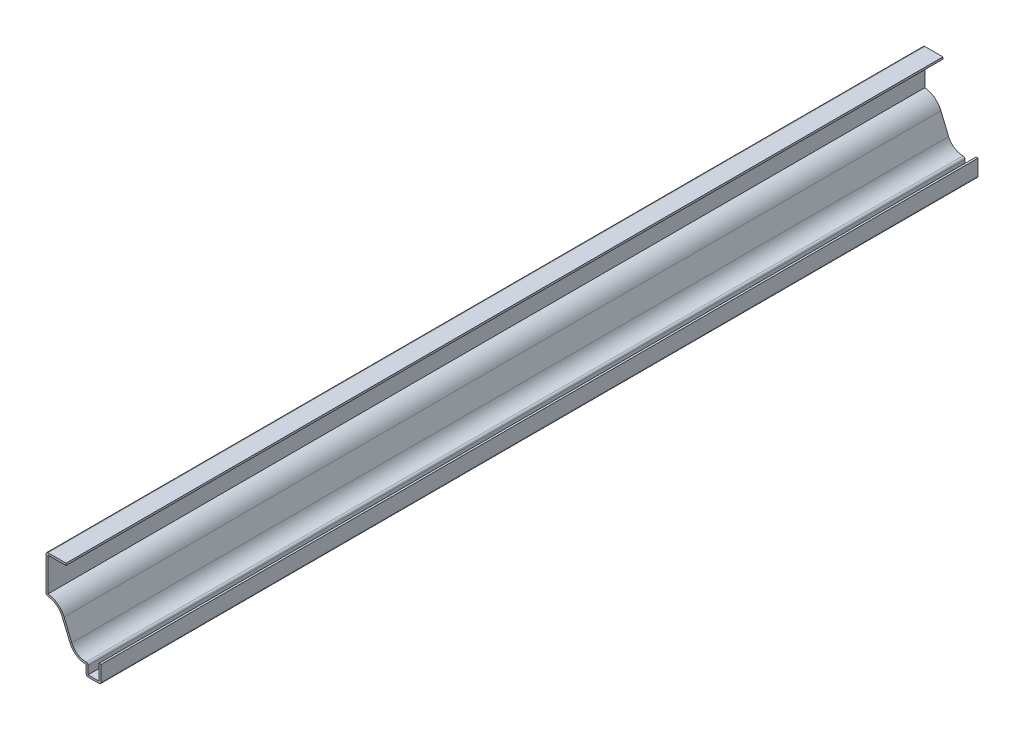
ISO-10303-21;
HEADER;
FILE_DESCRIPTION(('STEP AP214'),'2;1');
FILE_NAME('part.step','',(''),(''),'','','');
FILE_SCHEMA(('AUTOMOTIVE_DESIGN { 1 0 10303 214 1 1 1 1 }'));
ENDSEC;
DATA;
#1=APPLICATION_CONTEXT('core data for automotive mechanical design processes');
#2=APPLICATION_PROTOCOL_DEFINITION('international standard','automotive_design',2000,#1);
#3=PRODUCT_CONTEXT('',#1,'mechanical');
#4=PRODUCT('Part','Part','',(#3));
#5=PRODUCT_RELATED_PRODUCT_CATEGORY('part','',(#4));
#6=PRODUCT_DEFINITION_FORMATION('','',#4);
#7=PRODUCT_DEFINITION_CONTEXT('part definition',#1,'design');
#8=PRODUCT_DEFINITION('design','',#6,#7);
#9=PRODUCT_DEFINITION_SHAPE('','',#8);
#10=(LENGTH_UNIT() NAMED_UNIT(*) SI_UNIT(.MILLI.,.METRE.));
#11=(NAMED_UNIT(*) PLANE_ANGLE_UNIT() SI_UNIT($,.RADIAN.));
#12=(NAMED_UNIT(*) SI_UNIT($,.STERADIAN.) SOLID_ANGLE_UNIT());
#13=UNCERTAINTY_MEASURE_WITH_UNIT(LENGTH_MEASURE(1.E-05),#10,'distance_accuracy_value','');
#14=(GEOMETRIC_REPRESENTATION_CONTEXT(3) GLOBAL_UNCERTAINTY_ASSIGNED_CONTEXT((#13)) GLOBAL_UNIT_ASSIGNED_CONTEXT((#10,
#11,#12)) REPRESENTATION_CONTEXT('',''));
#15=CARTESIAN_POINT('',(0.,0.,0.));
#16=DIRECTION('',(0.,0.,1.));
#17=DIRECTION('',(1.,0.,0.));
#18=AXIS2_PLACEMENT_3D('',#15,#16,#17);
#19=CARTESIAN_POINT('',(-34.925,43.18,-555.625));
#20=DIRECTION('',(0.,-1.,0.));
#21=DIRECTION('',(0.,0.,-1.));
#22=AXIS2_PLACEMENT_3D('',#19,#20,#21);
#23=PLANE('',#22);
#24=DIRECTION('',(1.,0.,0.));
#25=VECTOR('',#24,1.);
#26=CARTESIAN_POINT('',(-34.925,43.18,0.));
#27=LINE('',#26,#25);
#28=CARTESIAN_POINT('',(-33.655,43.18,0.));
#29=VERTEX_POINT('',#28);
#30=CARTESIAN_POINT('',(-22.225,43.18,0.));
#31=VERTEX_POINT('',#30);
#32=EDGE_CURVE('E259',#29,#31,#27,.T.);
#33=ORIENTED_EDGE('',*,*,#32,.F.);
#34=DIRECTION('',(0.,0.,1.));
#35=VECTOR('',#34,1.);
#36=CARTESIAN_POINT('',(-33.655,43.18,-555.625));
#37=LINE('',#36,#35);
#38=CARTESIAN_POINT('',(-33.655,43.18,-555.625));
#39=VERTEX_POINT('',#38);
#40=EDGE_CURVE('E215',#39,#29,#37,.T.);
#41=ORIENTED_EDGE('',*,*,#40,.F.);
#42=DIRECTION('',(1.,0.,0.));
#43=VECTOR('',#42,1.);
#44=CARTESIAN_POINT('',(-34.925,43.18,-555.625));
#45=LINE('',#44,#43);
#46=CARTESIAN_POINT('',(-22.225,43.18,-555.625));
#47=VERTEX_POINT('',#46);
#48=EDGE_CURVE('E197',#39,#47,#45,.T.);
#49=ORIENTED_EDGE('',*,*,#48,.T.);
#50=DIRECTION('',(0.,0.,1.));
#51=VECTOR('',#50,1.);
#52=CARTESIAN_POINT('',(-22.225,43.18,-555.625));
#53=LINE('',#52,#51);
#54=EDGE_CURVE('E205',#47,#31,#53,.T.);
#55=ORIENTED_EDGE('',*,*,#54,.T.);
#56=EDGE_LOOP('',(#33,#41,#49,#55));
#57=FACE_BOUND('',#56,.T.);
#58=ADVANCED_FACE('F35',(#57),#23,.T.);
#59=CARTESIAN_POINT('',(-33.655,20.6375,-555.625));
#60=DIRECTION('',(1.,0.,0.));
#61=DIRECTION('',(0.,0.,-1.));
#62=AXIS2_PLACEMENT_3D('',#59,#60,#61);
#63=PLANE('',#62);
#64=DIRECTION('',(0.,1.,0.));
#65=VECTOR('',#64,1.);
#66=CARTESIAN_POINT('',(-33.655,20.6375,0.));
#67=LINE('',#66,#65);
#68=CARTESIAN_POINT('',(-33.655,21.842199610707,0.));
#69=VERTEX_POINT('',#68);
#70=EDGE_CURVE('E216',#69,#29,#67,.T.);
#71=ORIENTED_EDGE('',*,*,#70,.F.);
#72=DIRECTION('',(0.,0.,1.));
#73=VECTOR('',#72,1.);
#74=CARTESIAN_POINT('',(-33.655,21.842199610707,-555.625));
#75=LINE('',#74,#73);
#76=CARTESIAN_POINT('',(-33.655,21.842199610707,-555.625));
#77=VERTEX_POINT('',#76);
#78=EDGE_CURVE('E301',#77,#69,#75,.T.);
#79=ORIENTED_EDGE('',*,*,#78,.F.);
#80=DIRECTION('',(0.,1.,0.));
#81=VECTOR('',#80,1.);
#82=CARTESIAN_POINT('',(-33.655,20.6375,-555.625));
#83=LINE('',#82,#81);
#84=EDGE_CURVE('E213',#77,#39,#83,.T.);
#85=ORIENTED_EDGE('',*,*,#84,.T.);
#86=ORIENTED_EDGE('',*,*,#40,.T.);
#87=EDGE_LOOP('',(#71,#79,#85,#86));
#88=FACE_BOUND('',#87,.T.);
#89=ADVANCED_FACE('F387',(#88),#63,.T.);
#90=CARTESIAN_POINT('',(-34.925,9.525,-555.625));
#91=DIRECTION('',(0.,0.,1.));
#92=DIRECTION('',(1.,0.,0.));
#93=AXIS2_PLACEMENT_3D('',#90,#91,#92);
#94=CYLINDRICAL_SURFACE('',#93,12.3825);
#95=CARTESIAN_POINT('',(-34.925,9.525,0.));
#96=DIRECTION('',(0.,0.,1.));
#97=DIRECTION('',(1.,0.,0.));
#98=AXIS2_PLACEMENT_3D('',#95,#96,#97);
#99=CIRCLE('',#98,12.3825);
#100=CARTESIAN_POINT('',(-23.495,14.2875,0.));
#101=VERTEX_POINT('',#100);
#102=EDGE_CURVE('E219',#101,#69,#99,.T.);
#103=ORIENTED_EDGE('',*,*,#102,.F.);
#104=DIRECTION('',(0.,0.,1.));
#105=VECTOR('',#104,1.);
#106=CARTESIAN_POINT('',(-23.495,14.2875,-555.625));
#107=LINE('',#106,#105);
#108=CARTESIAN_POINT('',(-23.495,14.2875,-555.625));
#109=VERTEX_POINT('',#108);
#110=EDGE_CURVE('E303',#109,#101,#107,.T.);
#111=ORIENTED_EDGE('',*,*,#110,.F.);
#112=CARTESIAN_POINT('',(-34.925,9.525,-555.625));
#113=DIRECTION('',(0.,0.,1.));
#114=DIRECTION('',(1.,0.,0.));
#115=AXIS2_PLACEMENT_3D('',#112,#113,#114);
#116=CIRCLE('',#115,12.3825);
#117=EDGE_CURVE('E255',#109,#77,#116,.T.);
#118=ORIENTED_EDGE('',*,*,#117,.T.);
#119=ORIENTED_EDGE('',*,*,#78,.T.);
#120=EDGE_LOOP('',(#103,#111,#118,#119));
#121=FACE_BOUND('',#120,.T.);
#122=ADVANCED_FACE('F463',(#121),#94,.T.);
#123=CARTESIAN_POINT('',(-18.6103846153846,2.56442307692306,-555.625));
#124=DIRECTION('',(0.923076923076923,0.384615384615385,0.));
#125=DIRECTION('',(-0.384615384615385,0.923076923076923,0.));
#126=AXIS2_PLACEMENT_3D('',#123,#124,#125);
#127=PLANE('',#126);
#128=DIRECTION('',(-0.384615384615385,0.923076923076923,0.));
#129=VECTOR('',#128,1.);
#130=CARTESIAN_POINT('',(-18.6103846153846,2.56442307692306,0.));
#131=LINE('',#130,#129);
#132=CARTESIAN_POINT('',(-18.6103846153846,2.56442307692306,0.));
#133=VERTEX_POINT('',#132);
#134=EDGE_CURVE('E294',#133,#101,#131,.T.);
#135=ORIENTED_EDGE('',*,*,#134,.F.);
#136=DIRECTION('',(0.,0.,1.));
#137=VECTOR('',#136,1.);
#138=CARTESIAN_POINT('',(-18.6103846153846,2.56442307692306,-555.625));
#139=LINE('',#138,#137);
#140=CARTESIAN_POINT('',(-18.6103846153846,2.56442307692306,-555.625));
#141=VERTEX_POINT('',#140);
#142=EDGE_CURVE('E305',#141,#133,#139,.T.);
#143=ORIENTED_EDGE('',*,*,#142,.F.);
#144=DIRECTION('',(-0.384615384615385,0.923076923076923,0.));
#145=VECTOR('',#144,1.);
#146=CARTESIAN_POINT('',(-18.6103846153846,2.56442307692306,-555.625));
#147=LINE('',#146,#145);
#148=EDGE_CURVE('E252',#141,#109,#147,.T.);
#149=ORIENTED_EDGE('',*,*,#148,.T.);
#150=ORIENTED_EDGE('',*,*,#110,.T.);
#151=EDGE_LOOP('',(#135,#143,#149,#150));
#152=FACE_BOUND('',#151,.T.);
#153=ADVANCED_FACE('F395',(#152),#127,.T.);
#154=CARTESIAN_POINT('',(-9.525,6.35,-555.625));
#155=DIRECTION('',(0.,0.,1.));
#156=DIRECTION('',(1.,0.,0.));
#157=AXIS2_PLACEMENT_3D('',#154,#155,#156);
#158=CYLINDRICAL_SURFACE('',#157,9.8425);
#159=CARTESIAN_POINT('',(-9.525,6.35,0.));
#160=DIRECTION('',(0.,0.,1.));
#161=DIRECTION('',(1.,0.,0.));
#162=AXIS2_PLACEMENT_3D('',#159,#160,#161);
#163=CIRCLE('',#162,9.8425);
#164=CARTESIAN_POINT('',(-9.525,-3.49250000000001,0.));
#165=VERTEX_POINT('',#164);
#166=EDGE_CURVE('E292',#165,#133,#163,.F.);
#167=ORIENTED_EDGE('',*,*,#166,.F.);
#168=DIRECTION('',(0.,0.,1.));
#169=VECTOR('',#168,1.);
#170=CARTESIAN_POINT('',(-9.525,-3.49250000000001,-555.625));
#171=LINE('',#170,#169);
#172=CARTESIAN_POINT('',(-9.525,-3.49250000000001,-555.625));
#173=VERTEX_POINT('',#172);
#174=EDGE_CURVE('E358',#165,#173,#171,.F.);
#175=ORIENTED_EDGE('',*,*,#174,.T.);
#176=CARTESIAN_POINT('',(-9.525,6.35,-555.625));
#177=DIRECTION('',(0.,0.,1.));
#178=DIRECTION('',(1.,0.,0.));
#179=AXIS2_PLACEMENT_3D('',#176,#177,#178);
#180=CIRCLE('',#179,9.8425);
#181=EDGE_CURVE('E250',#173,#141,#180,.F.);
#182=ORIENTED_EDGE('',*,*,#181,.T.);
#183=ORIENTED_EDGE('',*,*,#142,.T.);
#184=EDGE_LOOP('',(#167,#175,#182,#183));
#185=FACE_BOUND('',#184,.T.);
#186=ADVANCED_FACE('F398',(#185),#158,.F.);
#187=CARTESIAN_POINT('',(-8.255,-11.1125,-555.625));
#188=DIRECTION('',(1.,0.,0.));
#189=DIRECTION('',(0.,0.,-1.));
#190=AXIS2_PLACEMENT_3D('',#187,#188,#189);
#191=PLANE('',#190);
#192=DIRECTION('',(0.,1.,0.));
#193=VECTOR('',#192,1.);
#194=CARTESIAN_POINT('',(-8.255,-11.1125,-555.625));
#195=LINE('',#194,#193);
#196=CARTESIAN_POINT('',(-8.255,-9.8425,-555.625));
#197=VERTEX_POINT('',#196);
#198=CARTESIAN_POINT('',(-8.255,-4.76250000000001,-555.625));
#199=VERTEX_POINT('',#198);
#200=EDGE_CURVE('E247',#197,#199,#195,.T.);
#201=ORIENTED_EDGE('',*,*,#200,.T.);
#202=DIRECTION('',(0.,0.,1.));
#203=VECTOR('',#202,1.);
#204=CARTESIAN_POINT('',(-8.255,-4.76250000000001,-555.625));
#205=LINE('',#204,#203);
#206=CARTESIAN_POINT('',(-8.255,-4.76250000000001,0.));
#207=VERTEX_POINT('',#206);
#208=EDGE_CURVE('E355',#199,#207,#205,.T.);
#209=ORIENTED_EDGE('',*,*,#208,.T.);
#210=DIRECTION('',(0.,1.,0.));
#211=VECTOR('',#210,1.);
#212=CARTESIAN_POINT('',(-8.255,-11.1125,0.));
#213=LINE('',#212,#211);
#214=CARTESIAN_POINT('',(-8.255,-9.8425,0.));
#215=VERTEX_POINT('',#214);
#216=EDGE_CURVE('E289',#215,#207,#213,.T.);
#217=ORIENTED_EDGE('',*,*,#216,.F.);
#218=DIRECTION('',(0.,0.,1.));
#219=VECTOR('',#218,1.);
#220=CARTESIAN_POINT('',(-8.255,-9.8425,-555.625));
#221=LINE('',#220,#219);
#222=EDGE_CURVE('E308',#197,#215,#221,.T.);
#223=ORIENTED_EDGE('',*,*,#222,.F.);
#224=EDGE_LOOP('',(#201,#209,#217,#223));
#225=FACE_BOUND('',#224,.T.);
#226=ADVANCED_FACE('F407',(#225),#191,.T.);
#227=CARTESIAN_POINT('',(0.,-9.8425,-555.625));
#228=DIRECTION('',(0.,1.,0.));
#229=DIRECTION('',(-1.,0.,0.));
#230=AXIS2_PLACEMENT_3D('',#227,#228,#229);
#231=PLANE('',#230);
#232=DIRECTION('',(-1.,0.,0.));
#233=VECTOR('',#232,1.);
#234=CARTESIAN_POINT('',(0.,-9.8425,0.));
#235=LINE('',#234,#233);
#236=CARTESIAN_POINT('',(-1.27,-9.8425,0.));
#237=VERTEX_POINT('',#236);
#238=EDGE_CURVE('E286',#237,#215,#235,.T.);
#239=ORIENTED_EDGE('',*,*,#238,.F.);
#240=DIRECTION('',(0.,0.,1.));
#241=VECTOR('',#240,1.);
#242=CARTESIAN_POINT('',(-1.27,-9.8425,-555.625));
#243=LINE('',#242,#241);
#244=CARTESIAN_POINT('',(-1.27,-9.8425,-555.625));
#245=VERTEX_POINT('',#244);
#246=EDGE_CURVE('E310',#245,#237,#243,.T.);
#247=ORIENTED_EDGE('',*,*,#246,.F.);
#248=DIRECTION('',(-1.,0.,0.));
#249=VECTOR('',#248,1.);
#250=CARTESIAN_POINT('',(0.,-9.8425,-555.625));
#251=LINE('',#250,#249);
#252=EDGE_CURVE('E244',#245,#197,#251,.T.);
#253=ORIENTED_EDGE('',*,*,#252,.T.);
#254=ORIENTED_EDGE('',*,*,#222,.T.);
#255=EDGE_LOOP('',(#239,#247,#253,#254));
#256=FACE_BOUND('',#255,.T.);
#257=ADVANCED_FACE('F412',(#256),#231,.T.);
#258=CARTESIAN_POINT('',(-1.27,0.,-555.625));
#259=DIRECTION('',(-1.,0.,0.));
#260=DIRECTION('',(0.,-1.,0.));
#261=AXIS2_PLACEMENT_3D('',#258,#259,#260);
#262=PLANE('',#261);
#263=DIRECTION('',(0.,-1.,0.));
#264=VECTOR('',#263,1.);
#265=CARTESIAN_POINT('',(-1.27,0.,0.));
#266=LINE('',#265,#264);
#267=CARTESIAN_POINT('',(-1.27,0.,0.));
#268=VERTEX_POINT('',#267);
#269=EDGE_CURVE('E283',#268,#237,#266,.T.);
#270=ORIENTED_EDGE('',*,*,#269,.F.);
#271=DIRECTION('',(0.,0.,1.));
#272=VECTOR('',#271,1.);
#273=CARTESIAN_POINT('',(-1.27,0.,-555.625));
#274=LINE('',#273,#272);
#275=CARTESIAN_POINT('',(-1.27,0.,-555.625));
#276=VERTEX_POINT('',#275);
#277=EDGE_CURVE('E312',#276,#268,#274,.T.);
#278=ORIENTED_EDGE('',*,*,#277,.F.);
#279=DIRECTION('',(0.,-1.,0.));
#280=VECTOR('',#279,1.);
#281=CARTESIAN_POINT('',(-1.27,0.,-555.625));
#282=LINE('',#281,#280);
#283=EDGE_CURVE('E241',#276,#245,#282,.T.);
#284=ORIENTED_EDGE('',*,*,#283,.T.);
#285=ORIENTED_EDGE('',*,*,#246,.T.);
#286=EDGE_LOOP('',(#270,#278,#284,#285));
#287=FACE_BOUND('',#286,.T.);
#288=ADVANCED_FACE('F416',(#287),#262,.T.);
#289=CARTESIAN_POINT('',(-1.27,0.,-555.625));
#290=DIRECTION('',(0.,-1.,0.));
#291=DIRECTION('',(1.,0.,0.));
#292=AXIS2_PLACEMENT_3D('',#289,#290,#291);
#293=PLANE('',#292);
#294=DIRECTION('',(1.,0.,0.));
#295=VECTOR('',#294,1.);
#296=CARTESIAN_POINT('',(-1.27,0.,0.));
#297=LINE('',#296,#295);
#298=CARTESIAN_POINT('',(0.,0.,0.));
#299=VERTEX_POINT('',#298);
#300=EDGE_CURVE('E281',#268,#299,#297,.T.);
#301=ORIENTED_EDGE('',*,*,#300,.T.);
#302=DIRECTION('',(0.,0.,1.));
#303=VECTOR('',#302,1.);
#304=CARTESIAN_POINT('',(0.,0.,-555.625));
#305=LINE('',#304,#303);
#306=CARTESIAN_POINT('',(0.,0.,-555.625));
#307=VERTEX_POINT('',#306);
#308=EDGE_CURVE('E314',#307,#299,#305,.T.);
#309=ORIENTED_EDGE('',*,*,#308,.F.);
#310=DIRECTION('',(1.,0.,0.));
#311=VECTOR('',#310,1.);
#312=CARTESIAN_POINT('',(-1.27,0.,-555.625));
#313=LINE('',#312,#311);
#314=EDGE_CURVE('E239',#276,#307,#313,.T.);
#315=ORIENTED_EDGE('',*,*,#314,.F.);
#316=ORIENTED_EDGE('',*,*,#277,.T.);
#317=EDGE_LOOP('',(#301,#309,#315,#316));
#318=FACE_BOUND('',#317,.T.);
#319=ADVANCED_FACE('F420',(#318),#293,.F.);
#320=CARTESIAN_POINT('',(0.,0.,-555.625));
#321=DIRECTION('',(-1.,0.,0.));
#322=DIRECTION('',(0.,-1.,0.));
#323=AXIS2_PLACEMENT_3D('',#320,#321,#322);
#324=PLANE('',#323);
#325=DIRECTION('',(0.,-1.,0.));
#326=VECTOR('',#325,1.);
#327=CARTESIAN_POINT('',(0.,0.,0.));
#328=LINE('',#327,#326);
#329=CARTESIAN_POINT('',(0.,-9.8425,0.));
#330=VERTEX_POINT('',#329);
#331=EDGE_CURVE('E278',#299,#330,#328,.T.);
#332=ORIENTED_EDGE('',*,*,#331,.T.);
#333=DIRECTION('',(0.,0.,1.));
#334=VECTOR('',#333,1.);
#335=CARTESIAN_POINT('',(0.,-9.8425,-555.625));
#336=LINE('',#335,#334);
#337=CARTESIAN_POINT('',(0.,-9.8425,-555.625));
#338=VERTEX_POINT('',#337);
#339=EDGE_CURVE('E341',#330,#338,#336,.F.);
#340=ORIENTED_EDGE('',*,*,#339,.T.);
#341=DIRECTION('',(0.,-1.,0.));
#342=VECTOR('',#341,1.);
#343=CARTESIAN_POINT('',(0.,0.,-555.625));
#344=LINE('',#343,#342);
#345=EDGE_CURVE('E237',#307,#338,#344,.T.);
#346=ORIENTED_EDGE('',*,*,#345,.F.);
#347=ORIENTED_EDGE('',*,*,#308,.T.);
#348=EDGE_LOOP('',(#332,#340,#346,#347));
#349=FACE_BOUND('',#348,.T.);
#350=ADVANCED_FACE('F560',(#349),#324,.F.);
#351=CARTESIAN_POINT('',(0.,-11.1125,-555.625));
#352=DIRECTION('',(0.,1.,0.));
#353=DIRECTION('',(-1.,0.,0.));
#354=AXIS2_PLACEMENT_3D('',#351,#352,#353);
#355=PLANE('',#354);
#356=DIRECTION('',(-1.,0.,0.));
#357=VECTOR('',#356,1.);
#358=CARTESIAN_POINT('',(0.,-11.1125,-555.625));
#359=LINE('',#358,#357);
#360=CARTESIAN_POINT('',(-1.27,-11.1125,-555.625));
#361=VERTEX_POINT('',#360);
#362=CARTESIAN_POINT('',(-8.255,-11.1125,-555.625));
#363=VERTEX_POINT('',#362);
#364=EDGE_CURVE('E234',#361,#363,#359,.T.);
#365=ORIENTED_EDGE('',*,*,#364,.F.);
#366=DIRECTION('',(0.,0.,1.));
#367=VECTOR('',#366,1.);
#368=CARTESIAN_POINT('',(-1.27,-11.1125,-555.625));
#369=LINE('',#368,#367);
#370=CARTESIAN_POINT('',(-1.27,-11.1125,0.));
#371=VERTEX_POINT('',#370);
#372=EDGE_CURVE('E328',#361,#371,#369,.T.);
#373=ORIENTED_EDGE('',*,*,#372,.T.);
#374=DIRECTION('',(-1.,0.,0.));
#375=VECTOR('',#374,1.);
#376=CARTESIAN_POINT('',(0.,-11.1125,0.));
#377=LINE('',#376,#375);
#378=CARTESIAN_POINT('',(-8.255,-11.1125,0.));
#379=VERTEX_POINT('',#378);
#380=EDGE_CURVE('E275',#371,#379,#377,.T.);
#381=ORIENTED_EDGE('',*,*,#380,.T.);
#382=DIRECTION('',(0.,0.,1.));
#383=VECTOR('',#382,1.);
#384=CARTESIAN_POINT('',(-8.255,-11.1125,-555.625));
#385=LINE('',#384,#383);
#386=EDGE_CURVE('E300',#379,#363,#385,.F.);
#387=ORIENTED_EDGE('',*,*,#386,.T.);
#388=EDGE_LOOP('',(#365,#373,#381,#387));
#389=FACE_BOUND('',#388,.T.);
#390=ADVANCED_FACE('F430',(#389),#355,.F.);
#391=CARTESIAN_POINT('',(-9.525,-11.1125,-555.625));
#392=DIRECTION('',(1.,0.,0.));
#393=DIRECTION('',(0.,0.,-1.));
#394=AXIS2_PLACEMENT_3D('',#391,#392,#393);
#395=PLANE('',#394);
#396=DIRECTION('',(0.,1.,0.));
#397=VECTOR('',#396,1.);
#398=CARTESIAN_POINT('',(-9.525,-11.1125,-555.625));
#399=LINE('',#398,#397);
#400=CARTESIAN_POINT('',(-9.525,-9.8425,-555.625));
#401=VERTEX_POINT('',#400);
#402=CARTESIAN_POINT('',(-9.525,-4.7625,-555.625));
#403=VERTEX_POINT('',#402);
#404=EDGE_CURVE('E232',#401,#403,#399,.T.);
#405=ORIENTED_EDGE('',*,*,#404,.F.);
#406=DIRECTION('',(0.,0.,1.));
#407=VECTOR('',#406,1.);
#408=CARTESIAN_POINT('',(-9.525,-9.8425,-555.625));
#409=LINE('',#408,#407);
#410=CARTESIAN_POINT('',(-9.525,-9.8425,0.));
#411=VERTEX_POINT('',#410);
#412=EDGE_CURVE('E352',#401,#411,#409,.T.);
#413=ORIENTED_EDGE('',*,*,#412,.T.);
#414=DIRECTION('',(0.,1.,0.));
#415=VECTOR('',#414,1.);
#416=CARTESIAN_POINT('',(-9.525,-11.1125,0.));
#417=LINE('',#416,#415);
#418=CARTESIAN_POINT('',(-9.525,-4.7625,0.));
#419=VERTEX_POINT('',#418);
#420=EDGE_CURVE('E273',#411,#419,#417,.T.);
#421=ORIENTED_EDGE('',*,*,#420,.T.);
#422=DIRECTION('',(0.,0.,1.));
#423=VECTOR('',#422,1.);
#424=CARTESIAN_POINT('',(-9.525,-4.7625,-555.625));
#425=LINE('',#424,#423);
#426=EDGE_CURVE('E317',#403,#419,#425,.T.);
#427=ORIENTED_EDGE('',*,*,#426,.F.);
#428=EDGE_LOOP('',(#405,#413,#421,#427));
#429=FACE_BOUND('',#428,.T.);
#430=ADVANCED_FACE('F441',(#429),#395,.F.);
#431=CARTESIAN_POINT('',(-9.525,6.35,-555.625));
#432=DIRECTION('',(0.,0.,1.));
#433=DIRECTION('',(1.,0.,0.));
#434=AXIS2_PLACEMENT_3D('',#431,#432,#433);
#435=CYLINDRICAL_SURFACE('',#434,11.1125);
#436=CARTESIAN_POINT('',(-9.525,6.35,0.));
#437=DIRECTION('',(0.,0.,-1.));
#438=DIRECTION('',(-1.,0.,0.));
#439=AXIS2_PLACEMENT_3D('',#436,#437,#438);
#440=CIRCLE('',#439,11.1125);
#441=CARTESIAN_POINT('',(-19.7826923076923,2.07596153846152,0.));
#442=VERTEX_POINT('',#441);
#443=EDGE_CURVE('E271',#419,#442,#440,.T.);
#444=ORIENTED_EDGE('',*,*,#443,.T.);
#445=DIRECTION('',(0.,0.,1.));
#446=VECTOR('',#445,1.);
#447=CARTESIAN_POINT('',(-19.7826923076923,2.07596153846152,-555.625));
#448=LINE('',#447,#446);
#449=CARTESIAN_POINT('',(-19.7826923076923,2.07596153846152,-555.625));
#450=VERTEX_POINT('',#449);
#451=EDGE_CURVE('E320',#450,#442,#448,.T.);
#452=ORIENTED_EDGE('',*,*,#451,.F.);
#453=CARTESIAN_POINT('',(-9.525,6.35,-555.625));
#454=DIRECTION('',(0.,0.,-1.));
#455=DIRECTION('',(-1.,0.,0.));
#456=AXIS2_PLACEMENT_3D('',#453,#454,#455);
#457=CIRCLE('',#456,11.1125);
#458=EDGE_CURVE('E230',#403,#450,#457,.T.);
#459=ORIENTED_EDGE('',*,*,#458,.F.);
#460=ORIENTED_EDGE('',*,*,#426,.T.);
#461=EDGE_LOOP('',(#444,#452,#459,#460));
#462=FACE_BOUND('',#461,.T.);
#463=ADVANCED_FACE('F446',(#462),#435,.T.);
#464=CARTESIAN_POINT('',(-19.7826923076923,2.07596153846153,-555.625));
#465=DIRECTION('',(0.923076923076923,0.384615384615385,0.));
#466=DIRECTION('',(-0.384615384615385,0.923076923076923,0.));
#467=AXIS2_PLACEMENT_3D('',#464,#465,#466);
#468=PLANE('',#467);
#469=DIRECTION('',(-0.384615384615385,0.923076923076923,0.));
#470=VECTOR('',#469,1.);
#471=CARTESIAN_POINT('',(-19.7826923076923,2.07596153846153,0.));
#472=LINE('',#471,#470);
#473=CARTESIAN_POINT('',(-24.6673076923077,13.7990384615385,0.));
#474=VERTEX_POINT('',#473);
#475=EDGE_CURVE('E269',#442,#474,#472,.T.);
#476=ORIENTED_EDGE('',*,*,#475,.T.);
#477=DIRECTION('',(0.,0.,1.));
#478=VECTOR('',#477,1.);
#479=CARTESIAN_POINT('',(-24.6673076923077,13.7990384615385,-555.625));
#480=LINE('',#479,#478);
#481=CARTESIAN_POINT('',(-24.6673076923077,13.7990384615385,-555.625));
#482=VERTEX_POINT('',#481);
#483=EDGE_CURVE('E323',#482,#474,#480,.T.);
#484=ORIENTED_EDGE('',*,*,#483,.F.);
#485=DIRECTION('',(-0.384615384615385,0.923076923076923,0.));
#486=VECTOR('',#485,1.);
#487=CARTESIAN_POINT('',(-19.7826923076923,2.07596153846153,-555.625));
#488=LINE('',#487,#486);
#489=EDGE_CURVE('E228',#450,#482,#488,.T.);
#490=ORIENTED_EDGE('',*,*,#489,.F.);
#491=ORIENTED_EDGE('',*,*,#451,.T.);
#492=EDGE_LOOP('',(#476,#484,#490,#491));
#493=FACE_BOUND('',#492,.T.);
#494=ADVANCED_FACE('F449',(#493),#468,.F.);
#495=CARTESIAN_POINT('',(-34.925,9.525,-555.625));
#496=DIRECTION('',(0.,0.,1.));
#497=DIRECTION('',(1.,0.,0.));
#498=AXIS2_PLACEMENT_3D('',#495,#496,#497);
#499=CYLINDRICAL_SURFACE('',#498,11.1125);
#500=CARTESIAN_POINT('',(-34.925,9.525,0.));
#501=DIRECTION('',(0.,0.,1.));
#502=DIRECTION('',(1.,0.,0.));
#503=AXIS2_PLACEMENT_3D('',#500,#501,#502);
#504=CIRCLE('',#503,11.1125);
#505=CARTESIAN_POINT('',(-33.7852564102564,20.5788970865319,0.));
#506=VERTEX_POINT('',#505);
#507=EDGE_CURVE('E266',#474,#506,#504,.T.);
#508=ORIENTED_EDGE('',*,*,#507,.T.);
#509=DIRECTION('',(0.,0.,1.));
#510=VECTOR('',#509,1.);
#511=CARTESIAN_POINT('',(-33.7852564102564,20.5788970865319,-555.625));
#512=LINE('',#511,#510);
#513=CARTESIAN_POINT('',(-33.7852564102564,20.5788970865319,-555.625));
#514=VERTEX_POINT('',#513);
#515=EDGE_CURVE('E43',#506,#514,#512,.F.);
#516=ORIENTED_EDGE('',*,*,#515,.T.);
#517=CARTESIAN_POINT('',(-34.925,9.525,-555.625));
#518=DIRECTION('',(0.,0.,1.));
#519=DIRECTION('',(1.,0.,0.));
#520=AXIS2_PLACEMENT_3D('',#517,#518,#519);
#521=CIRCLE('',#520,11.1125);
#522=EDGE_CURVE('E225',#482,#514,#521,.T.);
#523=ORIENTED_EDGE('',*,*,#522,.F.);
#524=ORIENTED_EDGE('',*,*,#483,.T.);
#525=EDGE_LOOP('',(#508,#516,#523,#524));
#526=FACE_BOUND('',#525,.T.);
#527=ADVANCED_FACE('F366',(#526),#499,.F.);
#528=CARTESIAN_POINT('',(-34.925,20.6375,-555.625));
#529=DIRECTION('',(1.,0.,0.));
#530=DIRECTION('',(0.,0.,-1.));
#531=AXIS2_PLACEMENT_3D('',#528,#529,#530);
#532=PLANE('',#531);
#533=DIRECTION('',(0.,1.,0.));
#534=VECTOR('',#533,1.);
#535=CARTESIAN_POINT('',(-34.925,20.6375,-555.625));
#536=LINE('',#535,#534);
#537=CARTESIAN_POINT('',(-34.925,21.842199610707,-555.625));
#538=VERTEX_POINT('',#537);
#539=CARTESIAN_POINT('',(-34.925,43.18,-555.625));
#540=VERTEX_POINT('',#539);
#541=EDGE_CURVE('E223',#538,#540,#536,.T.);
#542=ORIENTED_EDGE('',*,*,#541,.F.);
#543=DIRECTION('',(0.,0.,1.));
#544=VECTOR('',#543,1.);
#545=CARTESIAN_POINT('',(-34.925,21.842199610707,-555.625));
#546=LINE('',#545,#544);
#547=CARTESIAN_POINT('',(-34.925,21.842199610707,0.));
#548=VERTEX_POINT('',#547);
#549=EDGE_CURVE('E361',#538,#548,#546,.T.);
#550=ORIENTED_EDGE('',*,*,#549,.T.);
#551=DIRECTION('',(0.,1.,0.));
#552=VECTOR('',#551,1.);
#553=CARTESIAN_POINT('',(-34.925,20.6375,0.));
#554=LINE('',#553,#552);
#555=CARTESIAN_POINT('',(-34.925,43.18,0.));
#556=VERTEX_POINT('',#555);
#557=EDGE_CURVE('E264',#548,#556,#554,.T.);
#558=ORIENTED_EDGE('',*,*,#557,.T.);
#559=DIRECTION('',(0.,0.,1.));
#560=VECTOR('',#559,1.);
#561=CARTESIAN_POINT('',(-34.925,43.18,-555.625));
#562=LINE('',#561,#560);
#563=EDGE_CURVE('E58',#556,#540,#562,.F.);
#564=ORIENTED_EDGE('',*,*,#563,.T.);
#565=EDGE_LOOP('',(#542,#550,#558,#564));
#566=FACE_BOUND('',#565,.T.);
#567=ADVANCED_FACE('F375',(#566),#532,.F.);
#568=CARTESIAN_POINT('',(-34.925,44.45,-555.625));
#569=DIRECTION('',(0.,-1.,0.));
#570=DIRECTION('',(0.,0.,-1.));
#571=AXIS2_PLACEMENT_3D('',#568,#569,#570);
#572=PLANE('',#571);
#573=DIRECTION('',(1.,0.,0.));
#574=VECTOR('',#573,1.);
#575=CARTESIAN_POINT('',(-34.925,44.45,-555.625));
#576=LINE('',#575,#574);
#577=CARTESIAN_POINT('',(-33.655,44.45,-555.625));
#578=VERTEX_POINT('',#577);
#579=CARTESIAN_POINT('',(-22.225,44.45,-555.625));
#580=VERTEX_POINT('',#579);
#581=EDGE_CURVE('E199',#578,#580,#576,.T.);
#582=ORIENTED_EDGE('',*,*,#581,.F.);
#583=DIRECTION('',(0.,0.,1.));
#584=VECTOR('',#583,1.);
#585=CARTESIAN_POINT('',(-33.655,44.45,-555.625));
#586=LINE('',#585,#584);
#587=CARTESIAN_POINT('',(-33.655,44.45,0.));
#588=VERTEX_POINT('',#587);
#589=EDGE_CURVE('E11',#578,#588,#586,.T.);
#590=ORIENTED_EDGE('',*,*,#589,.T.);
#591=DIRECTION('',(1.,0.,0.));
#592=VECTOR('',#591,1.);
#593=CARTESIAN_POINT('',(-34.925,44.45,0.));
#594=LINE('',#593,#592);
#595=CARTESIAN_POINT('',(-22.225,44.45,0.));
#596=VERTEX_POINT('',#595);
#597=EDGE_CURVE('E262',#588,#596,#594,.T.);
#598=ORIENTED_EDGE('',*,*,#597,.T.);
#599=DIRECTION('',(0.,0.,1.));
#600=VECTOR('',#599,1.);
#601=CARTESIAN_POINT('',(-22.225,44.45,-555.625));
#602=LINE('',#601,#600);
#603=EDGE_CURVE('E212',#580,#596,#602,.T.);
#604=ORIENTED_EDGE('',*,*,#603,.F.);
#605=EDGE_LOOP('',(#582,#590,#598,#604));
#606=FACE_BOUND('',#605,.T.);
#607=ADVANCED_FACE('F383',(#606),#572,.F.);
#608=CARTESIAN_POINT('',(-22.225,44.45,-555.625));
#609=DIRECTION('',(-1.,0.,0.));
#610=DIRECTION('',(0.,0.,1.));
#611=AXIS2_PLACEMENT_3D('',#608,#609,#610);
#612=PLANE('',#611);
#613=DIRECTION('',(0.,-1.,0.));
#614=VECTOR('',#613,1.);
#615=CARTESIAN_POINT('',(-22.225,44.45,0.));
#616=LINE('',#615,#614);
#617=EDGE_CURVE('E208',#596,#31,#616,.T.);
#618=ORIENTED_EDGE('',*,*,#617,.T.);
#619=ORIENTED_EDGE('',*,*,#54,.F.);
#620=DIRECTION('',(0.,-1.,0.));
#621=VECTOR('',#620,1.);
#622=CARTESIAN_POINT('',(-22.225,44.45,-555.625));
#623=LINE('',#622,#621);
#624=EDGE_CURVE('E191',#580,#47,#623,.T.);
#625=ORIENTED_EDGE('',*,*,#624,.F.);
#626=ORIENTED_EDGE('',*,*,#603,.T.);
#627=EDGE_LOOP('',(#618,#619,#625,#626));
#628=FACE_BOUND('',#627,.T.);
#629=ADVANCED_FACE('F206',(#628),#612,.F.);
#630=CARTESIAN_POINT('',(-34.925,9.525,-555.625));
#631=DIRECTION('',(0.,0.,1.));
#632=DIRECTION('',(1.,0.,0.));
#633=AXIS2_PLACEMENT_3D('',#630,#631,#632);
#634=PLANE('',#633);
#635=ORIENTED_EDGE('',*,*,#345,.T.);
#636=CARTESIAN_POINT('',(-1.27,-9.8425,-555.625));
#637=DIRECTION('',(0.,0.,1.));
#638=DIRECTION('',(1.,0.,0.));
#639=AXIS2_PLACEMENT_3D('',#636,#637,#638);
#640=CIRCLE('',#639,1.27);
#641=EDGE_CURVE('E350',#338,#361,#640,.F.);
#642=ORIENTED_EDGE('',*,*,#641,.T.);
#643=ORIENTED_EDGE('',*,*,#364,.T.);
#644=CARTESIAN_POINT('',(-8.255,-9.8425,-555.625));
#645=DIRECTION('',(0.,0.,1.));
#646=DIRECTION('',(1.,0.,0.));
#647=AXIS2_PLACEMENT_3D('',#644,#645,#646);
#648=CIRCLE('',#647,1.27);
#649=EDGE_CURVE('E348',#363,#401,#648,.F.);
#650=ORIENTED_EDGE('',*,*,#649,.T.);
#651=ORIENTED_EDGE('',*,*,#404,.T.);
#652=ORIENTED_EDGE('',*,*,#458,.T.);
#653=ORIENTED_EDGE('',*,*,#489,.T.);
#654=ORIENTED_EDGE('',*,*,#522,.T.);
#655=CARTESIAN_POINT('',(-33.655,21.842199610707,-555.625));
#656=DIRECTION('',(0.,0.,1.));
#657=DIRECTION('',(1.,0.,0.));
#658=AXIS2_PLACEMENT_3D('',#655,#656,#657);
#659=CIRCLE('',#658,1.27);
#660=EDGE_CURVE('E344',#514,#538,#659,.F.);
#661=ORIENTED_EDGE('',*,*,#660,.T.);
#662=ORIENTED_EDGE('',*,*,#541,.T.);
#663=CARTESIAN_POINT('',(-33.655,43.18,-555.625));
#664=DIRECTION('',(0.,0.,1.));
#665=DIRECTION('',(1.,0.,0.));
#666=AXIS2_PLACEMENT_3D('',#663,#664,#665);
#667=CIRCLE('',#666,1.27);
#668=EDGE_CURVE('E50',#540,#578,#667,.F.);
#669=ORIENTED_EDGE('',*,*,#668,.T.);
#670=ORIENTED_EDGE('',*,*,#581,.T.);
#671=ORIENTED_EDGE('',*,*,#624,.T.);
#672=ORIENTED_EDGE('',*,*,#48,.F.);
#673=ORIENTED_EDGE('',*,*,#84,.F.);
#674=ORIENTED_EDGE('',*,*,#117,.F.);
#675=ORIENTED_EDGE('',*,*,#148,.F.);
#676=ORIENTED_EDGE('',*,*,#181,.F.);
#677=CARTESIAN_POINT('',(-9.525,-4.76250000000001,-555.625));
#678=DIRECTION('',(0.,0.,1.));
#679=DIRECTION('',(1.,0.,0.));
#680=AXIS2_PLACEMENT_3D('',#677,#678,#679);
#681=CIRCLE('',#680,1.27);
#682=EDGE_CURVE('E346',#173,#199,#681,.F.);
#683=ORIENTED_EDGE('',*,*,#682,.T.);
#684=ORIENTED_EDGE('',*,*,#200,.F.);
#685=ORIENTED_EDGE('',*,*,#252,.F.);
#686=ORIENTED_EDGE('',*,*,#283,.F.);
#687=ORIENTED_EDGE('',*,*,#314,.T.);
#688=EDGE_LOOP('',(#635,#642,#643,#650,#651,#652,#653,#654,#661,#662,#669,#670,#671,#672,#673,
#674,#675,#676,#683,#684,#685,#686,#687));
#689=FACE_BOUND('',#688,.T.);
#690=ADVANCED_FACE('F194',(#689),#634,.F.);
#691=CARTESIAN_POINT('',(-34.925,9.525,0.));
#692=DIRECTION('',(0.,0.,1.));
#693=DIRECTION('',(1.,0.,0.));
#694=AXIS2_PLACEMENT_3D('',#691,#692,#693);
#695=PLANE('',#694);
#696=ORIENTED_EDGE('',*,*,#380,.F.);
#697=CARTESIAN_POINT('',(-1.27,-9.8425,0.));
#698=DIRECTION('',(0.,0.,1.));
#699=DIRECTION('',(1.,0.,0.));
#700=AXIS2_PLACEMENT_3D('',#697,#698,#699);
#701=CIRCLE('',#700,1.27);
#702=EDGE_CURVE('E339',#371,#330,#701,.T.);
#703=ORIENTED_EDGE('',*,*,#702,.T.);
#704=ORIENTED_EDGE('',*,*,#331,.F.);
#705=ORIENTED_EDGE('',*,*,#300,.F.);
#706=ORIENTED_EDGE('',*,*,#269,.T.);
#707=ORIENTED_EDGE('',*,*,#238,.T.);
#708=ORIENTED_EDGE('',*,*,#216,.T.);
#709=CARTESIAN_POINT('',(-9.525,-4.76250000000001,0.));
#710=DIRECTION('',(0.,0.,1.));
#711=DIRECTION('',(1.,0.,0.));
#712=AXIS2_PLACEMENT_3D('',#709,#710,#711);
#713=CIRCLE('',#712,1.27);
#714=EDGE_CURVE('E335',#207,#165,#713,.T.);
#715=ORIENTED_EDGE('',*,*,#714,.T.);
#716=ORIENTED_EDGE('',*,*,#166,.T.);
#717=ORIENTED_EDGE('',*,*,#134,.T.);
#718=ORIENTED_EDGE('',*,*,#102,.T.);
#719=ORIENTED_EDGE('',*,*,#70,.T.);
#720=ORIENTED_EDGE('',*,*,#32,.T.);
#721=ORIENTED_EDGE('',*,*,#617,.F.);
#722=ORIENTED_EDGE('',*,*,#597,.F.);
#723=CARTESIAN_POINT('',(-33.655,43.18,0.));
#724=DIRECTION('',(0.,0.,1.));
#725=DIRECTION('',(1.,0.,0.));
#726=AXIS2_PLACEMENT_3D('',#723,#724,#725);
#727=CIRCLE('',#726,1.27);
#728=EDGE_CURVE('E331',#588,#556,#727,.T.);
#729=ORIENTED_EDGE('',*,*,#728,.T.);
#730=ORIENTED_EDGE('',*,*,#557,.F.);
#731=CARTESIAN_POINT('',(-33.655,21.842199610707,0.));
#732=DIRECTION('',(0.,0.,1.));
#733=DIRECTION('',(1.,0.,0.));
#734=AXIS2_PLACEMENT_3D('',#731,#732,#733);
#735=CIRCLE('',#734,1.27);
#736=EDGE_CURVE('E333',#548,#506,#735,.T.);
#737=ORIENTED_EDGE('',*,*,#736,.T.);
#738=ORIENTED_EDGE('',*,*,#507,.F.);
#739=ORIENTED_EDGE('',*,*,#475,.F.);
#740=ORIENTED_EDGE('',*,*,#443,.F.);
#741=ORIENTED_EDGE('',*,*,#420,.F.);
#742=CARTESIAN_POINT('',(-8.255,-9.8425,0.));
#743=DIRECTION('',(0.,0.,1.));
#744=DIRECTION('',(1.,0.,0.));
#745=AXIS2_PLACEMENT_3D('',#742,#743,#744);
#746=CIRCLE('',#745,1.27);
#747=EDGE_CURVE('E337',#411,#379,#746,.T.);
#748=ORIENTED_EDGE('',*,*,#747,.T.);
#749=EDGE_LOOP('',(#696,#703,#704,#705,#706,#707,#708,#715,#716,#717,#718,#719,#720,#721,#722,
#729,#730,#737,#738,#739,#740,#741,#748));
#750=FACE_BOUND('',#749,.T.);
#751=ADVANCED_FACE('F378',(#750),#695,.T.);
#752=CARTESIAN_POINT('',(-1.27,-9.8425,-555.625));
#753=DIRECTION('',(0.,0.,1.));
#754=DIRECTION('',(1.,0.,0.));
#755=AXIS2_PLACEMENT_3D('',#752,#753,#754);
#756=CYLINDRICAL_SURFACE('',#755,1.27);
#757=ORIENTED_EDGE('',*,*,#641,.F.);
#758=ORIENTED_EDGE('',*,*,#339,.F.);
#759=ORIENTED_EDGE('',*,*,#702,.F.);
#760=ORIENTED_EDGE('',*,*,#372,.F.);
#761=EDGE_LOOP('',(#757,#758,#759,#760));
#762=FACE_BOUND('',#761,.T.);
#763=ADVANCED_FACE('F428',(#762),#756,.T.);
#764=CARTESIAN_POINT('',(-8.255,-9.8425,-555.625));
#765=DIRECTION('',(0.,0.,1.));
#766=DIRECTION('',(1.,0.,0.));
#767=AXIS2_PLACEMENT_3D('',#764,#765,#766);
#768=CYLINDRICAL_SURFACE('',#767,1.27);
#769=ORIENTED_EDGE('',*,*,#649,.F.);
#770=ORIENTED_EDGE('',*,*,#386,.F.);
#771=ORIENTED_EDGE('',*,*,#747,.F.);
#772=ORIENTED_EDGE('',*,*,#412,.F.);
#773=EDGE_LOOP('',(#769,#770,#771,#772));
#774=FACE_BOUND('',#773,.T.);
#775=ADVANCED_FACE('F438',(#774),#768,.T.);
#776=CARTESIAN_POINT('',(-9.525,-4.76250000000001,-555.625));
#777=DIRECTION('',(0.,0.,1.));
#778=DIRECTION('',(1.,0.,0.));
#779=AXIS2_PLACEMENT_3D('',#776,#777,#778);
#780=CYLINDRICAL_SURFACE('',#779,1.27);
#781=ORIENTED_EDGE('',*,*,#682,.F.);
#782=ORIENTED_EDGE('',*,*,#174,.F.);
#783=ORIENTED_EDGE('',*,*,#714,.F.);
#784=ORIENTED_EDGE('',*,*,#208,.F.);
#785=EDGE_LOOP('',(#781,#782,#783,#784));
#786=FACE_BOUND('',#785,.T.);
#787=ADVANCED_FACE('F404',(#786),#780,.T.);
#788=CARTESIAN_POINT('',(-33.655,21.842199610707,-555.625));
#789=DIRECTION('',(0.,0.,1.));
#790=DIRECTION('',(1.,0.,0.));
#791=AXIS2_PLACEMENT_3D('',#788,#789,#790);
#792=CYLINDRICAL_SURFACE('',#791,1.27);
#793=ORIENTED_EDGE('',*,*,#660,.F.);
#794=ORIENTED_EDGE('',*,*,#515,.F.);
#795=ORIENTED_EDGE('',*,*,#736,.F.);
#796=ORIENTED_EDGE('',*,*,#549,.F.);
#797=EDGE_LOOP('',(#793,#794,#795,#796));
#798=FACE_BOUND('',#797,.T.);
#799=ADVANCED_FACE('F373',(#798),#792,.T.);
#800=CARTESIAN_POINT('',(-33.655,43.18,-555.625));
#801=DIRECTION('',(0.,0.,1.));
#802=DIRECTION('',(1.,0.,0.));
#803=AXIS2_PLACEMENT_3D('',#800,#801,#802);
#804=CYLINDRICAL_SURFACE('',#803,1.27);
#805=ORIENTED_EDGE('',*,*,#668,.F.);
#806=ORIENTED_EDGE('',*,*,#563,.F.);
#807=ORIENTED_EDGE('',*,*,#728,.F.);
#808=ORIENTED_EDGE('',*,*,#589,.F.);
#809=EDGE_LOOP('',(#805,#806,#807,#808));
#810=FACE_BOUND('',#809,.T.);
#811=ADVANCED_FACE('F37',(#810),#804,.T.);
#812=CLOSED_SHELL('',(#58,#89,#122,#153,#186,#226,#257,#288,#319,#350,#390,#430,#463,#494,#527,
#567,#607,#629,#690,#751,#763,#775,#787,#799,#811));
#813=MANIFOLD_SOLID_BREP('B2',#812);
#814=ADVANCED_BREP_SHAPE_REPRESENTATION('',(#18,#813),#14);
#815=SHAPE_DEFINITION_REPRESENTATION(#9,#814);
ENDSEC;
END-ISO-10303-21;
